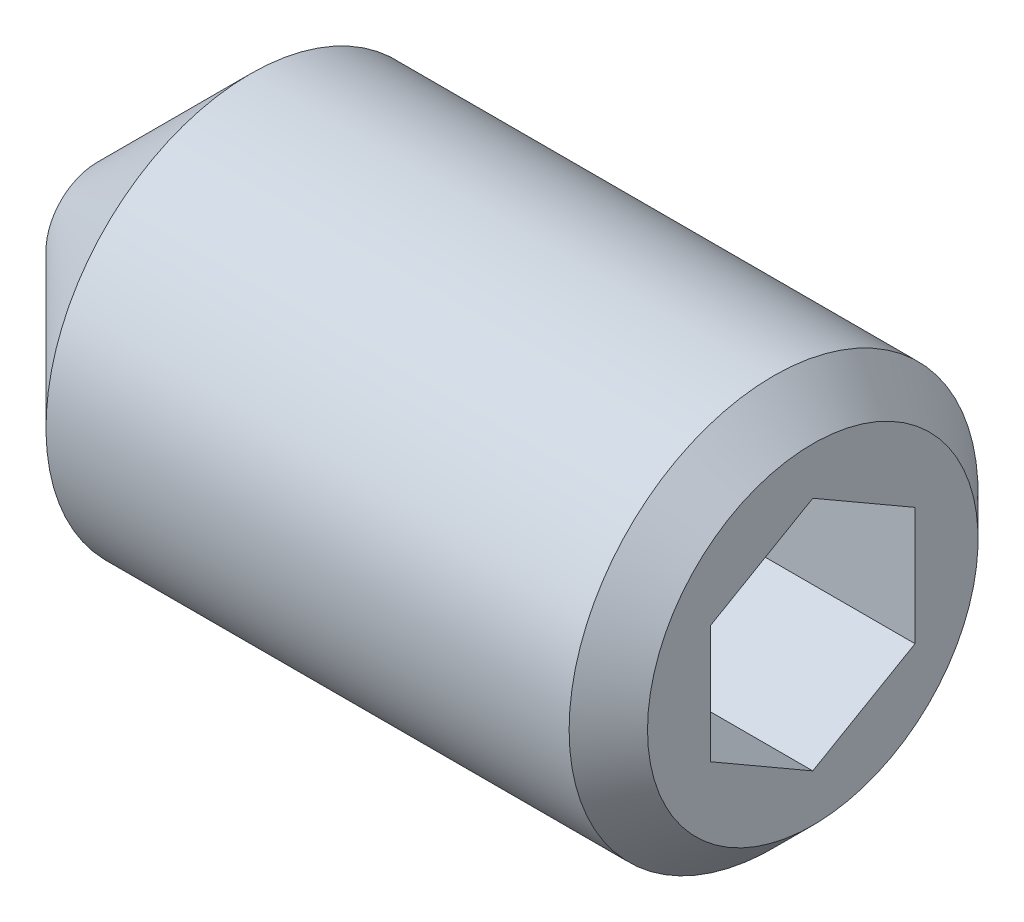
ISO-10303-21;
HEADER;
FILE_DESCRIPTION(('STEP AP214'),'2;1');
FILE_NAME('part.step','',(''),(''),'','','');
FILE_SCHEMA(('AUTOMOTIVE_DESIGN { 1 0 10303 214 1 1 1 1 }'));
ENDSEC;
DATA;
#1=APPLICATION_CONTEXT('core data for automotive mechanical design processes');
#2=APPLICATION_PROTOCOL_DEFINITION('international standard','automotive_design',2000,#1);
#3=PRODUCT_CONTEXT('',#1,'mechanical');
#4=PRODUCT('Part','Part','',(#3));
#5=PRODUCT_RELATED_PRODUCT_CATEGORY('part','',(#4));
#6=PRODUCT_DEFINITION_FORMATION('','',#4);
#7=PRODUCT_DEFINITION_CONTEXT('part definition',#1,'design');
#8=PRODUCT_DEFINITION('design','',#6,#7);
#9=PRODUCT_DEFINITION_SHAPE('','',#8);
#10=(LENGTH_UNIT() NAMED_UNIT(*) SI_UNIT(.MILLI.,.METRE.));
#11=(NAMED_UNIT(*) PLANE_ANGLE_UNIT() SI_UNIT($,.RADIAN.));
#12=(NAMED_UNIT(*) SI_UNIT($,.STERADIAN.) SOLID_ANGLE_UNIT());
#13=UNCERTAINTY_MEASURE_WITH_UNIT(LENGTH_MEASURE(1.E-05),#10,'distance_accuracy_value','');
#14=(GEOMETRIC_REPRESENTATION_CONTEXT(3) GLOBAL_UNCERTAINTY_ASSIGNED_CONTEXT((#13)) GLOBAL_UNIT_ASSIGNED_CONTEXT((#10,
#11,#12)) REPRESENTATION_CONTEXT('',''));
#15=CARTESIAN_POINT('',(0.,0.,0.));
#16=DIRECTION('',(0.,0.,1.));
#17=DIRECTION('',(1.,0.,0.));
#18=AXIS2_PLACEMENT_3D('',#15,#16,#17);
#19=CARTESIAN_POINT('',(9.00800000118807,0.,0.));
#20=DIRECTION('',(1.,0.,0.));
#21=DIRECTION('',(0.,0.,-1.));
#22=AXIS2_PLACEMENT_3D('',#19,#20,#21);
#23=CONICAL_SURFACE('',#22,2.32325748214635,1.04719754985041);
#24=CARTESIAN_POINT('',(7.66666666464744,-1.70530256582424E-10,0.));
#25=VERTEX_POINT('',#24);
#26=VERTEX_LOOP('',#25);
#27=FACE_BOUND('',#26,.T.);
#28=CARTESIAN_POINT('',(9.00000000144632,-1.1547005388733,1.99999999980313));
#29=CARTESIAN_POINT('',(8.97069554661901,-1.20544263425079,1.9121121121046));
#30=CARTESIAN_POINT('',(8.94404467857055,-1.25662273477581,1.82346557748557));
#31=CARTESIAN_POINT('',(8.89752638878152,-1.35986908512504,1.64463765285765));
#32=CARTESIAN_POINT('',(8.87767542165244,-1.41193716884017,1.55445308645704));
#33=CARTESIAN_POINT('',(8.84677596017859,-1.51542808258427,1.37520156576378));
#34=CARTESIAN_POINT('',(8.83552178881234,-1.56683499367059,1.28616218389005));
#35=CARTESIAN_POINT('',(8.82208916933915,-1.66989057615404,1.10766467901636));
#36=CARTESIAN_POINT('',(8.81989959519307,-1.72153887322915,1.01820720436114));
#37=CARTESIAN_POINT('',(8.82446629142046,-1.81803817556745,0.851065509818308));
#38=CARTESIAN_POINT('',(8.83010128650724,-1.86290366133762,0.773356208957408));
#39=CARTESIAN_POINT('',(8.8479573020661,-1.95234234887182,0.61844385798539));
#40=CARTESIAN_POINT('',(8.86018441614834,-1.99691524152218,0.541241343274824));
#41=CARTESIAN_POINT('',(8.89074983478849,-2.0865381811873,0.386009858251314));
#42=CARTESIAN_POINT('',(8.90921764370782,-2.13157689093158,0.308000524666825));
#43=CARTESIAN_POINT('',(8.95113176241171,-2.22098275234762,0.153145030199717));
#44=CARTESIAN_POINT('',(8.97456823036794,-2.26535104852824,0.0762968869695697));
#45=CARTESIAN_POINT('',(9.00000000166053,-2.3094010765472,3.65972336919312E-10));
#46=B_SPLINE_CURVE_WITH_KNOTS('',3,(#28,#29,#30,#31,#32,#33,#34,#35,#36,#37,#38,#39,#40,#41,#42,
#43,#44,#45),.UNSPECIFIED.,.F.,.F.,(4,2,2,2,2,2,2,2,4),(0.,0.317016011630611,0.634793817186324,
0.944707606358906,1.25424088914511,1.52370778262934,1.79342419354458,2.06912162200915,
2.34427797280119),.UNSPECIFIED.);
#47=CARTESIAN_POINT('',(9.00000000164541,-1.15470053826051,1.99999999979432));
#48=VERTEX_POINT('',#47);
#49=CARTESIAN_POINT('',(9.00000000171396,-2.30940107663975,2.05669987642726E-10));
#50=VERTEX_POINT('',#49);
#51=EDGE_CURVE('E19',#48,#50,#46,.T.);
#52=ORIENTED_EDGE('',*,*,#51,.T.);
#53=CARTESIAN_POINT('',(9.00000000144633,-2.30940107683503,-5.26293975634497E-10));
#54=CARTESIAN_POINT('',(8.97069554661902,-2.25865898109189,-0.0878878880137153));
#55=CARTESIAN_POINT('',(8.94404467857055,-2.20747888041687,-0.176534422546136));
#56=CARTESIAN_POINT('',(8.89752638878152,-2.10423252995766,-0.355362347110558));
#57=CARTESIAN_POINT('',(8.87767542165244,-2.05216444628301,-0.445546913534539));
#58=CARTESIAN_POINT('',(8.84677596017859,-1.9486735325677,-0.624798434244422));
#59=CARTESIAN_POINT('',(8.83552178881234,-1.89726662147095,-0.713837816112135));
#60=CARTESIAN_POINT('',(8.82208916933915,-1.79421103897993,-0.892335320981448));
#61=CARTESIAN_POINT('',(8.81989959519307,-1.74256274190766,-0.981792795638309));
#62=CARTESIAN_POINT('',(8.82446629142046,-1.64606343957113,-1.14893449018216));
#63=CARTESIAN_POINT('',(8.83010128650723,-1.60119795380035,-1.22664379104272));
#64=CARTESIAN_POINT('',(8.8479573020661,-1.51175926626571,-1.38155614201448));
#65=CARTESIAN_POINT('',(8.86018441614834,-1.4671863736155,-1.45875865672513));
#66=CARTESIAN_POINT('',(8.89074983478849,-1.37756343395052,-1.61399014174872));
#67=CARTESIAN_POINT('',(8.90921764370782,-1.3325247242062,-1.69199947533319));
#68=CARTESIAN_POINT('',(8.95113176241171,-1.2431188627901,-1.84685496980026));
#69=CARTESIAN_POINT('',(8.97456823036794,-1.19875056660944,-1.92370311303039));
#70=CARTESIAN_POINT('',(9.00000000166053,-1.15470053859054,-1.99999999963402));
#71=B_SPLINE_CURVE_WITH_KNOTS('',3,(#53,#54,#55,#56,#57,#58,#59,#60,#61,#62,#63,#64,#65,#66,#67,
#68,#69,#70),.UNSPECIFIED.,.F.,.F.,(4,2,2,2,2,2,2,2,4),(0.,0.317016011630612,0.634793817186325,
0.944707606358909,1.25424088914511,1.52370778262934,1.79342419354459,2.06912162200916,
2.34427797280119),.UNSPECIFIED.);
#72=CARTESIAN_POINT('',(9.00000000171396,-1.15470053849799,-1.99999999979432));
#73=VERTEX_POINT('',#72);
#74=EDGE_CURVE('E109',#50,#73,#71,.T.);
#75=ORIENTED_EDGE('',*,*,#74,.T.);
#76=CARTESIAN_POINT('',(9.00000000144632,-1.15470053796173,-2.00000000032942));
#77=CARTESIAN_POINT('',(8.97069554661902,-1.05321634684111,-2.00000000011831));
#78=CARTESIAN_POINT('',(8.94404467857055,-0.950856145641067,-2.00000000003171));
#79=CARTESIAN_POINT('',(8.89752638878152,-0.744363444832626,-1.99999999996821));
#80=CARTESIAN_POINT('',(8.87767542165244,-0.640227277442849,-1.99999999999158));
#81=CARTESIAN_POINT('',(8.84677596017859,-0.433245449983443,-2.0000000000082));
#82=CARTESIAN_POINT('',(8.83552178881234,-0.330431627800365,-2.00000000000219));
#83=CARTESIAN_POINT('',(8.82208916933915,-0.124320462825891,-1.99999999999781));
#84=CARTESIAN_POINT('',(8.81989959519307,-0.0210238686785109,-1.99999999999945));
#85=CARTESIAN_POINT('',(8.82446629142046,0.171974735996308,-2.00000000000047));
#86=CARTESIAN_POINT('',(8.83010128650723,0.261705707537264,-2.00000000000013));
#87=CARTESIAN_POINT('',(8.8479573020661,0.440583082606101,-1.99999999999987));
#88=CARTESIAN_POINT('',(8.86018441614834,0.529728867906677,-1.99999999999996));
#89=CARTESIAN_POINT('',(8.89074983478849,0.708974747236779,-2.00000000000004));
#90=CARTESIAN_POINT('',(8.90921764370782,0.799052166725384,-2.00000000000002));
#91=CARTESIAN_POINT('',(8.95113176241171,0.977863889557518,-1.99999999999998));
#92=CARTESIAN_POINT('',(8.97456823036794,1.0666004819188,-1.99999999999996));
#93=CARTESIAN_POINT('',(9.00000000166053,1.15470053795666,-2.));
#94=B_SPLINE_CURVE_WITH_KNOTS('',3,(#76,#77,#78,#79,#80,#81,#82,#83,#84,#85,#86,#87,#88,#89,#90,
#91,#92,#93),.UNSPECIFIED.,.F.,.F.,(4,2,2,2,2,2,2,2,4),(0.,0.317016011630611,0.634793817186325,
0.944707606358907,1.25424088914511,1.52370778262934,1.79342419354459,2.06912162200916,
2.34427797280119),.UNSPECIFIED.);
#95=CARTESIAN_POINT('',(9.00000000171396,1.15470053814176,-1.99999999999999));
#96=VERTEX_POINT('',#95);
#97=EDGE_CURVE('E105',#73,#96,#94,.T.);
#98=ORIENTED_EDGE('',*,*,#97,.T.);
#99=CARTESIAN_POINT('',(9.00000000144632,1.1547005388733,-1.99999999980313));
#100=CARTESIAN_POINT('',(8.97069554661901,1.20544263425078,-1.91211211210459));
#101=CARTESIAN_POINT('',(8.94404467857055,1.2566227347758,-1.82346557748557));
#102=CARTESIAN_POINT('',(8.89752638878151,1.35986908512503,-1.64463765285765));
#103=CARTESIAN_POINT('',(8.87767542165244,1.41193716884016,-1.55445308645704));
#104=CARTESIAN_POINT('',(8.84677596017859,1.51542808258426,-1.37520156576378));
#105=CARTESIAN_POINT('',(8.83552178881233,1.56683499367058,-1.28616218389005));
#106=CARTESIAN_POINT('',(8.82208916933915,1.66989057615403,-1.10766467901636));
#107=CARTESIAN_POINT('',(8.81989959519306,1.72153887322914,-1.01820720436114));
#108=CARTESIAN_POINT('',(8.82446629142046,1.81803817556744,-0.85106550981831));
#109=CARTESIAN_POINT('',(8.83010128650723,1.86290366133761,-0.773356208957409));
#110=CARTESIAN_POINT('',(8.8479573020661,1.95234234887181,-0.61844385798539));
#111=CARTESIAN_POINT('',(8.86018441614834,1.99691524152217,-0.541241343274824));
#112=CARTESIAN_POINT('',(8.89074983478849,2.08653818118729,-0.386009858251314));
#113=CARTESIAN_POINT('',(8.90921764370782,2.13157689093158,-0.308000524666825));
#114=CARTESIAN_POINT('',(8.95113176241171,2.22098275234761,-0.153145030199716));
#115=CARTESIAN_POINT('',(8.97456823036794,2.26535104852824,-0.0762968869695689));
#116=CARTESIAN_POINT('',(9.00000000166053,2.3094010765472,-3.65971082070167E-10));
#117=B_SPLINE_CURVE_WITH_KNOTS('',3,(#99,#100,#101,#102,#103,#104,#105,#106,#107,#108,#109,#110,
#111,#112,#113,#114,#115,#116),.UNSPECIFIED.,.F.,.F.,(4,2,2,2,2,2,2,2,4),(0.,0.31701601163061,
0.634793817186322,0.944707606358904,1.2542408891451,1.52370778262934,1.79342419354458,
2.06912162200915,2.34427797280119),.UNSPECIFIED.);
#118=CARTESIAN_POINT('',(9.00000000171396,2.30940107663975,-2.05673827678857E-10));
#119=VERTEX_POINT('',#118);
#120=EDGE_CURVE('E101',#96,#119,#117,.T.);
#121=ORIENTED_EDGE('',*,*,#120,.T.);
#122=CARTESIAN_POINT('',(9.00000000144632,2.30940107683503,5.26291496868138E-10));
#123=CARTESIAN_POINT('',(8.97069554661901,2.25865898109189,0.0878878880137124));
#124=CARTESIAN_POINT('',(8.94404467857055,2.20747888041687,0.176534422546133));
#125=CARTESIAN_POINT('',(8.89752638878151,2.10423252995766,0.355362347110554));
#126=CARTESIAN_POINT('',(8.87767542165244,2.05216444628301,0.445546913534534));
#127=CARTESIAN_POINT('',(8.84677596017859,1.9486735325677,0.624798434244417));
#128=CARTESIAN_POINT('',(8.83552178881233,1.89726662147095,0.713837816112129));
#129=CARTESIAN_POINT('',(8.82208916933915,1.79421103897992,0.892335320981442));
#130=CARTESIAN_POINT('',(8.81989959519306,1.74256274190765,0.981792795638302));
#131=CARTESIAN_POINT('',(8.82446629142046,1.64606343957113,1.14893449018216));
#132=CARTESIAN_POINT('',(8.83010128650723,1.60119795380035,1.22664379104271));
#133=CARTESIAN_POINT('',(8.8479573020661,1.51175926626571,1.38155614201447));
#134=CARTESIAN_POINT('',(8.86018441614834,1.4671863736155,1.45875865672513));
#135=CARTESIAN_POINT('',(8.89074983478849,1.37756343395051,1.61399014174872));
#136=CARTESIAN_POINT('',(8.90921764370782,1.33252472420619,1.69199947533319));
#137=CARTESIAN_POINT('',(8.95113176241171,1.24311886279009,1.84685496980026));
#138=CARTESIAN_POINT('',(8.97456823036794,1.19875056660943,1.92370311303039));
#139=CARTESIAN_POINT('',(9.00000000166053,1.15470053859053,1.99999999963403));
#140=B_SPLINE_CURVE_WITH_KNOTS('',3,(#122,#123,#124,#125,#126,#127,#128,#129,#130,#131,#132,
#133,#134,#135,#136,#137,#138,#139),.UNSPECIFIED.,.F.,.F.,(4,2,2,2,2,2,2,2,4),(0.,
0.317016011630611,0.634793817186323,0.944707606358905,1.25424088914511,1.52370778262934,
1.79342419354459,2.06912162200916,2.3442779728012),.UNSPECIFIED.);
#141=CARTESIAN_POINT('',(9.00000000171396,1.15470053849799,1.99999999979432));
#142=VERTEX_POINT('',#141);
#143=EDGE_CURVE('E84',#119,#142,#140,.T.);
#144=ORIENTED_EDGE('',*,*,#143,.T.);
#145=CARTESIAN_POINT('',(9.00000000144632,1.15470053796172,2.00000000032942));
#146=CARTESIAN_POINT('',(8.97069554661901,1.0532163468411,2.00000000011831));
#147=CARTESIAN_POINT('',(8.94404467857055,0.950856145641057,2.00000000003171));
#148=CARTESIAN_POINT('',(8.89752638878151,0.744363444832616,1.99999999996821));
#149=CARTESIAN_POINT('',(8.87767542165244,0.64022727744284,1.99999999999158));
#150=CARTESIAN_POINT('',(8.84677596017859,0.433245449983435,2.0000000000082));
#151=CARTESIAN_POINT('',(8.83552178881233,0.330431627800356,2.00000000000218));
#152=CARTESIAN_POINT('',(8.82208916933915,0.124320462825883,1.99999999999781));
#153=CARTESIAN_POINT('',(8.81989959519307,0.0210238686785036,1.99999999999945));
#154=CARTESIAN_POINT('',(8.82446629142046,-0.171974735996315,2.00000000000047));
#155=CARTESIAN_POINT('',(8.83010128650724,-0.261705707537271,2.00000000000013));
#156=CARTESIAN_POINT('',(8.8479573020661,-0.440583082606108,1.99999999999987));
#157=CARTESIAN_POINT('',(8.86018441614834,-0.529728867906684,1.99999999999996));
#158=CARTESIAN_POINT('',(8.89074983478849,-0.708974747236785,2.00000000000003));
#159=CARTESIAN_POINT('',(8.90921764370782,-0.79905216672539,2.00000000000002));
#160=CARTESIAN_POINT('',(8.95113176241171,-0.977863889557524,1.99999999999998));
#161=CARTESIAN_POINT('',(8.97456823036794,-1.06660048191881,1.99999999999996));
#162=CARTESIAN_POINT('',(9.00000000166053,-1.15470053795667,2.));
#163=B_SPLINE_CURVE_WITH_KNOTS('',3,(#145,#146,#147,#148,#149,#150,#151,#152,#153,#154,#155,
#156,#157,#158,#159,#160,#161,#162),.UNSPECIFIED.,.F.,.F.,(4,2,2,2,2,2,2,2,4),(0.,
0.31701601163061,0.634793817186323,0.944707606358904,1.2542408891451,1.52370778262934,
1.79342419354458,2.06912162200915,2.34427797280119),.UNSPECIFIED.);
#164=EDGE_CURVE('E82',#142,#48,#163,.T.);
#165=ORIENTED_EDGE('',*,*,#164,.T.);
#166=EDGE_LOOP('',(#52,#75,#98,#121,#144,#165));
#167=FACE_BOUND('',#166,.T.);
#168=ADVANCED_FACE('F15',(#27,#167),#23,.F.);
#169=CARTESIAN_POINT('',(14.,-1.15470053837926,1.99999999999999));
#170=DIRECTION('',(0.,-0.86602540378444,0.499999999999998));
#171=DIRECTION('',(0.,-0.499999999999998,-0.86602540378444));
#172=AXIS2_PLACEMENT_3D('',#169,#170,#171);
#173=PLANE('',#172);
#174=DIRECTION('',(1.,0.,0.));
#175=VECTOR('',#174,1.);
#176=CARTESIAN_POINT('',(14.,-1.15470053837926,2.));
#177=LINE('',#176,#175);
#178=CARTESIAN_POINT('',(14.,-1.15470053837926,2.));
#179=VERTEX_POINT('',#178);
#180=EDGE_CURVE('E75',#48,#179,#177,.T.);
#181=ORIENTED_EDGE('',*,*,#180,.T.);
#182=DIRECTION('',(0.,-0.499999999999997,-0.86602540378444));
#183=VECTOR('',#182,1.);
#184=CARTESIAN_POINT('',(14.,-1.15470053837926,1.99999999999999));
#185=LINE('',#184,#183);
#186=CARTESIAN_POINT('',(14.,-2.3094010767585,0.));
#187=VERTEX_POINT('',#186);
#188=EDGE_CURVE('E86',#179,#187,#185,.T.);
#189=ORIENTED_EDGE('',*,*,#188,.T.);
#190=DIRECTION('',(1.,0.,0.));
#191=VECTOR('',#190,1.);
#192=CARTESIAN_POINT('',(14.,-2.3094010767585,0.));
#193=LINE('',#192,#191);
#194=EDGE_CURVE('E78',#187,#50,#193,.F.);
#195=ORIENTED_EDGE('',*,*,#194,.T.);
#196=ORIENTED_EDGE('',*,*,#51,.F.);
#197=EDGE_LOOP('',(#181,#189,#195,#196));
#198=FACE_BOUND('',#197,.T.);
#199=ADVANCED_FACE('F73',(#198),#173,.F.);
#200=CARTESIAN_POINT('',(14.,-2.3094010767585,0.));
#201=DIRECTION('',(0.,-0.866025403784437,-0.500000000000003));
#202=DIRECTION('',(0.,0.500000000000003,-0.866025403784437));
#203=AXIS2_PLACEMENT_3D('',#200,#201,#202);
#204=PLANE('',#203);
#205=ORIENTED_EDGE('',*,*,#194,.F.);
#206=DIRECTION('',(0.,0.500000000000003,-0.866025403784437));
#207=VECTOR('',#206,1.);
#208=CARTESIAN_POINT('',(14.,-2.3094010767585,0.));
#209=LINE('',#208,#207);
#210=CARTESIAN_POINT('',(14.,-1.15470053837925,-2.));
#211=VERTEX_POINT('',#210);
#212=EDGE_CURVE('E116',#187,#211,#209,.T.);
#213=ORIENTED_EDGE('',*,*,#212,.T.);
#214=DIRECTION('',(-1.,0.,0.));
#215=VECTOR('',#214,1.);
#216=CARTESIAN_POINT('',(14.,-1.15470053837925,-2.));
#217=LINE('',#216,#215);
#218=EDGE_CURVE('E106',#211,#73,#217,.T.);
#219=ORIENTED_EDGE('',*,*,#218,.T.);
#220=ORIENTED_EDGE('',*,*,#74,.F.);
#221=EDGE_LOOP('',(#205,#213,#219,#220));
#222=FACE_BOUND('',#221,.T.);
#223=ADVANCED_FACE('F161',(#222),#204,.F.);
#224=CARTESIAN_POINT('',(14.,-1.15470053837925,-2.));
#225=DIRECTION('',(0.,0.,-1.));
#226=DIRECTION('',(-1.,0.,0.));
#227=AXIS2_PLACEMENT_3D('',#224,#225,#226);
#228=PLANE('',#227);
#229=ORIENTED_EDGE('',*,*,#218,.F.);
#230=DIRECTION('',(0.,1.,0.));
#231=VECTOR('',#230,1.);
#232=CARTESIAN_POINT('',(14.,0.,-2.));
#233=LINE('',#232,#231);
#234=CARTESIAN_POINT('',(14.,1.15470053837925,-1.99999999999999));
#235=VERTEX_POINT('',#234);
#236=EDGE_CURVE('E118',#211,#235,#233,.T.);
#237=ORIENTED_EDGE('',*,*,#236,.T.);
#238=DIRECTION('',(1.,0.,0.));
#239=VECTOR('',#238,1.);
#240=CARTESIAN_POINT('',(14.,1.15470053837925,-1.99999999999999));
#241=LINE('',#240,#239);
#242=EDGE_CURVE('E102',#235,#96,#241,.F.);
#243=ORIENTED_EDGE('',*,*,#242,.T.);
#244=ORIENTED_EDGE('',*,*,#97,.F.);
#245=EDGE_LOOP('',(#229,#237,#243,#244));
#246=FACE_BOUND('',#245,.T.);
#247=ADVANCED_FACE('F147',(#246),#228,.F.);
#248=CARTESIAN_POINT('',(14.,1.15470053837925,-1.99999999999999));
#249=DIRECTION('',(0.,0.86602540378444,-0.499999999999998));
#250=DIRECTION('',(0.,0.499999999999998,0.86602540378444));
#251=AXIS2_PLACEMENT_3D('',#248,#249,#250);
#252=PLANE('',#251);
#253=ORIENTED_EDGE('',*,*,#242,.F.);
#254=DIRECTION('',(0.,0.500000000000001,0.866025403784438));
#255=VECTOR('',#254,1.);
#256=CARTESIAN_POINT('',(14.,1.15470053837925,-1.99999999999999));
#257=LINE('',#256,#255);
#258=CARTESIAN_POINT('',(14.,2.3094010767585,0.));
#259=VERTEX_POINT('',#258);
#260=EDGE_CURVE('E112',#235,#259,#257,.T.);
#261=ORIENTED_EDGE('',*,*,#260,.T.);
#262=DIRECTION('',(1.,0.,0.));
#263=VECTOR('',#262,1.);
#264=CARTESIAN_POINT('',(14.,2.3094010767585,0.));
#265=LINE('',#264,#263);
#266=EDGE_CURVE('E95',#259,#119,#265,.F.);
#267=ORIENTED_EDGE('',*,*,#266,.T.);
#268=ORIENTED_EDGE('',*,*,#120,.F.);
#269=EDGE_LOOP('',(#253,#261,#267,#268));
#270=FACE_BOUND('',#269,.T.);
#271=ADVANCED_FACE('F143',(#270),#252,.F.);
#272=CARTESIAN_POINT('',(14.,2.30940107675849,0.));
#273=DIRECTION('',(0.,0.866025403784437,0.500000000000002));
#274=DIRECTION('',(0.,-0.500000000000002,0.866025403784437));
#275=AXIS2_PLACEMENT_3D('',#272,#273,#274);
#276=PLANE('',#275);
#277=ORIENTED_EDGE('',*,*,#266,.F.);
#278=DIRECTION('',(0.,-0.500000000000003,0.866025403784437));
#279=VECTOR('',#278,1.);
#280=CARTESIAN_POINT('',(14.,2.3094010767585,0.));
#281=LINE('',#280,#279);
#282=CARTESIAN_POINT('',(14.,1.15470053837924,2.));
#283=VERTEX_POINT('',#282);
#284=EDGE_CURVE('E37',#259,#283,#281,.T.);
#285=ORIENTED_EDGE('',*,*,#284,.T.);
#286=DIRECTION('',(1.,0.,0.));
#287=VECTOR('',#286,1.);
#288=CARTESIAN_POINT('',(14.,1.15470053837924,2.));
#289=LINE('',#288,#287);
#290=EDGE_CURVE('E87',#283,#142,#289,.F.);
#291=ORIENTED_EDGE('',*,*,#290,.T.);
#292=ORIENTED_EDGE('',*,*,#143,.F.);
#293=EDGE_LOOP('',(#277,#285,#291,#292));
#294=FACE_BOUND('',#293,.T.);
#295=ADVANCED_FACE('F138',(#294),#276,.F.);
#296=CARTESIAN_POINT('',(14.,1.15470053837924,2.));
#297=DIRECTION('',(0.,0.,1.));
#298=DIRECTION('',(1.,0.,0.));
#299=AXIS2_PLACEMENT_3D('',#296,#297,#298);
#300=PLANE('',#299);
#301=ORIENTED_EDGE('',*,*,#290,.F.);
#302=DIRECTION('',(0.,1.,0.));
#303=VECTOR('',#302,1.);
#304=CARTESIAN_POINT('',(14.,0.,2.));
#305=LINE('',#304,#303);
#306=EDGE_CURVE('E91',#283,#179,#305,.F.);
#307=ORIENTED_EDGE('',*,*,#306,.T.);
#308=ORIENTED_EDGE('',*,*,#180,.F.);
#309=ORIENTED_EDGE('',*,*,#164,.F.);
#310=EDGE_LOOP('',(#301,#307,#308,#309));
#311=FACE_BOUND('',#310,.T.);
#312=ADVANCED_FACE('F89',(#311),#300,.F.);
#313=CARTESIAN_POINT('',(0.,2.,0.));
#314=DIRECTION('',(-1.,0.,0.));
#315=DIRECTION('',(0.,0.,1.));
#316=AXIS2_PLACEMENT_3D('',#313,#314,#315);
#317=PLANE('',#316);
#318=CARTESIAN_POINT('',(-1.36424205265939E-09,0.,0.));
#319=DIRECTION('',(1.,0.,0.));
#320=DIRECTION('',(0.,1.,0.));
#321=AXIS2_PLACEMENT_3D('',#318,#319,#320);
#322=CIRCLE('',#321,1.00000000128375);
#323=CARTESIAN_POINT('',(-1.36424216107961E-09,1.00000000128375,0.));
#324=VERTEX_POINT('',#323);
#325=EDGE_CURVE('E114',#324,#324,#322,.T.);
#326=ORIENTED_EDGE('',*,*,#325,.F.);
#327=EDGE_LOOP('',(#326));
#328=FACE_BOUND('',#327,.T.);
#329=ADVANCED_FACE('F137',(#328),#317,.T.);
#330=CARTESIAN_POINT('',(14.,0.,0.));
#331=DIRECTION('',(-1.,0.,0.));
#332=DIRECTION('',(0.,0.,1.));
#333=AXIS2_PLACEMENT_3D('',#330,#331,#332);
#334=PLANE('',#333);
#335=ORIENTED_EDGE('',*,*,#284,.F.);
#336=ORIENTED_EDGE('',*,*,#260,.F.);
#337=ORIENTED_EDGE('',*,*,#236,.F.);
#338=ORIENTED_EDGE('',*,*,#212,.F.);
#339=ORIENTED_EDGE('',*,*,#188,.F.);
#340=ORIENTED_EDGE('',*,*,#306,.F.);
#341=EDGE_LOOP('',(#335,#336,#337,#338,#339,#340));
#342=FACE_BOUND('',#341,.T.);
#343=CARTESIAN_POINT('',(14.0000000002942,0.,0.));
#344=DIRECTION('',(-1.,0.,0.));
#345=DIRECTION('',(0.,0.,1.));
#346=AXIS2_PLACEMENT_3D('',#343,#344,#345);
#347=CIRCLE('',#346,3.23318750031376);
#348=CARTESIAN_POINT('',(14.0000000002942,0.,3.23318750031376));
#349=VERTEX_POINT('',#348);
#350=EDGE_CURVE('E121',#349,#349,#347,.T.);
#351=ORIENTED_EDGE('',*,*,#350,.F.);
#352=EDGE_LOOP('',(#351));
#353=FACE_BOUND('',#352,.T.);
#354=ADVANCED_FACE('F186',(#342,#353),#334,.F.);
#355=CARTESIAN_POINT('',(3.00000000135014,0.,0.));
#356=DIRECTION('',(1.,0.,0.));
#357=DIRECTION('',(0.,1.,0.));
#358=AXIS2_PLACEMENT_3D('',#355,#356,#357);
#359=CONICAL_SURFACE('',#358,3.99999999865486,0.785398162506902);
#360=CARTESIAN_POINT('',(3.,0.,0.));
#361=DIRECTION('',(1.,0.,0.));
#362=DIRECTION('',(0.,1.,0.));
#363=AXIS2_PLACEMENT_3D('',#360,#361,#362);
#364=CIRCLE('',#363,4.);
#365=CARTESIAN_POINT('',(3.,4.,0.));
#366=VERTEX_POINT('',#365);
#367=EDGE_CURVE('E28',#366,#366,#364,.T.);
#368=ORIENTED_EDGE('',*,*,#367,.F.);
#369=EDGE_LOOP('',(#368));
#370=FACE_BOUND('',#369,.T.);
#371=ORIENTED_EDGE('',*,*,#325,.T.);
#372=EDGE_LOOP('',(#371));
#373=FACE_BOUND('',#372,.T.);
#374=ADVANCED_FACE('F180',(#370,#373),#359,.T.);
#375=CARTESIAN_POINT('',(13.2331874996794,0.,0.));
#376=DIRECTION('',(-1.,0.,0.));
#377=DIRECTION('',(0.,0.,1.));
#378=AXIS2_PLACEMENT_3D('',#375,#376,#377);
#379=CONICAL_SURFACE('',#378,3.9999999996212,0.785398162544959);
#380=ORIENTED_EDGE('',*,*,#350,.T.);
#381=EDGE_LOOP('',(#380));
#382=FACE_BOUND('',#381,.T.);
#383=CARTESIAN_POINT('',(13.2331875,0.,0.));
#384=DIRECTION('',(1.,0.,0.));
#385=DIRECTION('',(0.,1.,0.));
#386=AXIS2_PLACEMENT_3D('',#383,#384,#385);
#387=CIRCLE('',#386,4.);
#388=CARTESIAN_POINT('',(13.2331875,4.,0.));
#389=VERTEX_POINT('',#388);
#390=EDGE_CURVE('E10',#389,#389,#387,.F.);
#391=ORIENTED_EDGE('',*,*,#390,.F.);
#392=EDGE_LOOP('',(#391));
#393=FACE_BOUND('',#392,.T.);
#394=ADVANCED_FACE('F174',(#382,#393),#379,.T.);
#395=CARTESIAN_POINT('',(7.,0.,0.));
#396=DIRECTION('',(1.,0.,0.));
#397=DIRECTION('',(0.,1.,0.));
#398=AXIS2_PLACEMENT_3D('',#395,#396,#397);
#399=CYLINDRICAL_SURFACE('',#398,4.);
#400=ORIENTED_EDGE('',*,*,#390,.T.);
#401=EDGE_LOOP('',(#400));
#402=FACE_BOUND('',#401,.T.);
#403=ORIENTED_EDGE('',*,*,#367,.T.);
#404=EDGE_LOOP('',(#403));
#405=FACE_BOUND('',#404,.T.);
#406=ADVANCED_FACE('F172',(#402,#405),#399,.T.);
#407=CLOSED_SHELL('',(#168,#199,#223,#247,#271,#295,#312,#329,#354,#374,#394,#406));
#408=MANIFOLD_SOLID_BREP('B1',#407);
#409=ADVANCED_BREP_SHAPE_REPRESENTATION('',(#18,#408),#14);
#410=SHAPE_DEFINITION_REPRESENTATION(#9,#409);
ENDSEC;
END-ISO-10303-21;
